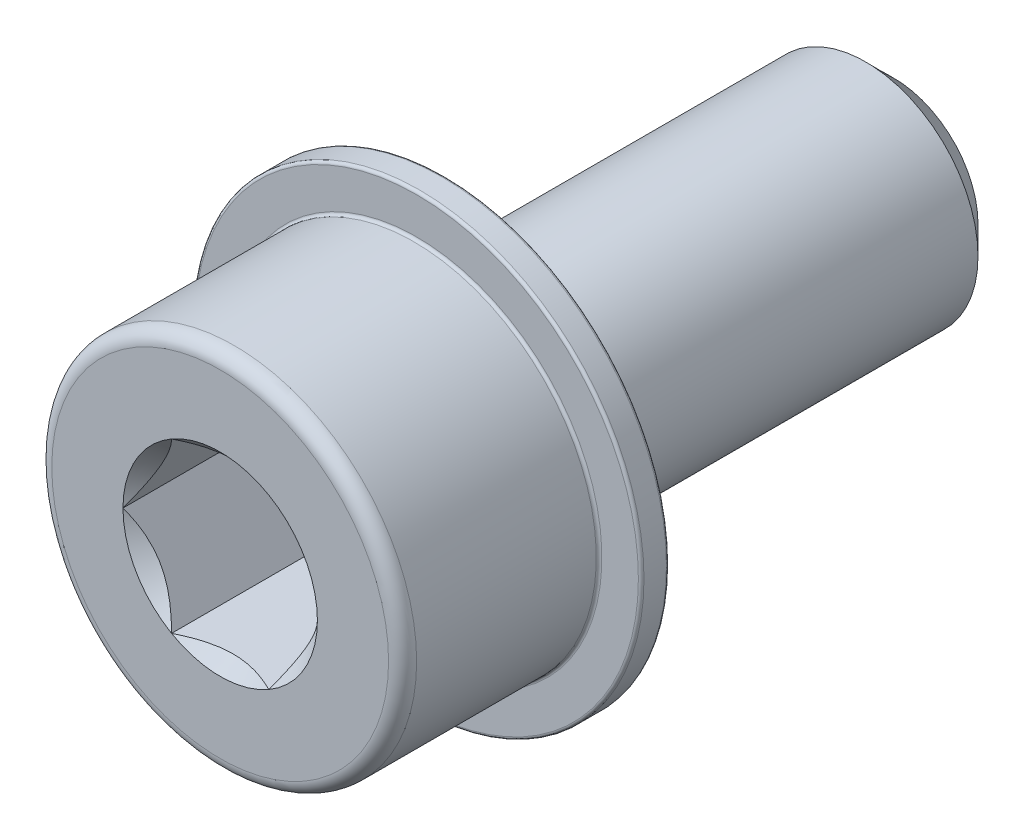
ISO-10303-21;
HEADER;
FILE_DESCRIPTION(('STEP AP214'),'2;1');
FILE_NAME('part.step','',(''),(''),'','','');
FILE_SCHEMA(('AUTOMOTIVE_DESIGN { 1 0 10303 214 1 1 1 1 }'));
ENDSEC;
DATA;
#1=APPLICATION_CONTEXT('core data for automotive mechanical design processes');
#2=APPLICATION_PROTOCOL_DEFINITION('international standard','automotive_design',2000,#1);
#3=PRODUCT_CONTEXT('',#1,'mechanical');
#4=PRODUCT('Part','Part','',(#3));
#5=PRODUCT_RELATED_PRODUCT_CATEGORY('part','',(#4));
#6=PRODUCT_DEFINITION_FORMATION('','',#4);
#7=PRODUCT_DEFINITION_CONTEXT('part definition',#1,'design');
#8=PRODUCT_DEFINITION('design','',#6,#7);
#9=PRODUCT_DEFINITION_SHAPE('','',#8);
#10=(LENGTH_UNIT() NAMED_UNIT(*) SI_UNIT(.MILLI.,.METRE.));
#11=(NAMED_UNIT(*) PLANE_ANGLE_UNIT() SI_UNIT($,.RADIAN.));
#12=(NAMED_UNIT(*) SI_UNIT($,.STERADIAN.) SOLID_ANGLE_UNIT());
#13=UNCERTAINTY_MEASURE_WITH_UNIT(LENGTH_MEASURE(1.E-05),#10,'distance_accuracy_value','');
#14=(GEOMETRIC_REPRESENTATION_CONTEXT(3) GLOBAL_UNCERTAINTY_ASSIGNED_CONTEXT((#13)) GLOBAL_UNIT_ASSIGNED_CONTEXT((#10,
#11,#12)) REPRESENTATION_CONTEXT('',''));
#15=CARTESIAN_POINT('',(0.,0.,0.));
#16=DIRECTION('',(0.,0.,1.));
#17=DIRECTION('',(1.,0.,0.));
#18=AXIS2_PLACEMENT_3D('',#15,#16,#17);
#19=CARTESIAN_POINT('',(0.,0.,24.));
#20=DIRECTION('',(0.,0.,-1.));
#21=DIRECTION('',(-1.,0.,0.));
#22=AXIS2_PLACEMENT_3D('',#19,#20,#21);
#23=CYLINDRICAL_SURFACE('',#22,6.5);
#24=CARTESIAN_POINT('',(0.,0.,17.1));
#25=DIRECTION('',(0.,0.,-1.));
#26=DIRECTION('',(-1.,0.,0.));
#27=AXIS2_PLACEMENT_3D('',#24,#25,#26);
#28=CIRCLE('',#27,6.5);
#29=CARTESIAN_POINT('',(-6.5,0.,17.1));
#30=VERTEX_POINT('',#29);
#31=EDGE_CURVE('E11',#30,#30,#28,.F.);
#32=ORIENTED_EDGE('',*,*,#31,.T.);
#33=EDGE_LOOP('',(#32));
#34=FACE_BOUND('',#33,.T.);
#35=CARTESIAN_POINT('',(0.,0.,23.5));
#36=DIRECTION('',(0.,0.,1.));
#37=DIRECTION('',(1.,0.,0.));
#38=AXIS2_PLACEMENT_3D('',#35,#36,#37);
#39=CIRCLE('',#38,6.5);
#40=CARTESIAN_POINT('',(6.5,0.,23.5));
#41=VERTEX_POINT('',#40);
#42=EDGE_CURVE('E256',#41,#41,#39,.F.);
#43=ORIENTED_EDGE('',*,*,#42,.T.);
#44=EDGE_LOOP('',(#43));
#45=FACE_BOUND('',#44,.T.);
#46=ADVANCED_FACE('F34',(#34,#45),#23,.T.);
#47=CARTESIAN_POINT('',(0.,0.,24.));
#48=DIRECTION('',(0.,0.,1.));
#49=DIRECTION('',(1.,0.,0.));
#50=AXIS2_PLACEMENT_3D('',#47,#48,#49);
#51=PLANE('',#50);
#52=CARTESIAN_POINT('',(0.,0.,24.));
#53=DIRECTION('',(0.,0.,1.));
#54=DIRECTION('',(1.,0.,0.));
#55=AXIS2_PLACEMENT_3D('',#52,#53,#54);
#56=CIRCLE('',#55,6.);
#57=CARTESIAN_POINT('',(6.,0.,24.));
#58=VERTEX_POINT('',#57);
#59=EDGE_CURVE('E107',#58,#58,#56,.T.);
#60=ORIENTED_EDGE('',*,*,#59,.T.);
#61=EDGE_LOOP('',(#60));
#62=FACE_BOUND('',#61,.T.);
#63=CARTESIAN_POINT('',(0.,0.,24.));
#64=DIRECTION('',(0.,0.,1.));
#65=DIRECTION('',(1.,0.,0.));
#66=AXIS2_PLACEMENT_3D('',#63,#64,#65);
#67=CIRCLE('',#66,3.46410161513776);
#68=CARTESIAN_POINT('',(3.46410161513776,0.,24.));
#69=VERTEX_POINT('',#68);
#70=CARTESIAN_POINT('',(1.73205080756888,3.,24.));
#71=VERTEX_POINT('',#70);
#72=EDGE_CURVE('E88',#69,#71,#67,.T.);
#73=ORIENTED_EDGE('',*,*,#72,.F.);
#74=CARTESIAN_POINT('',(1.73205080756888,-3.,24.));
#75=VERTEX_POINT('',#74);
#76=EDGE_CURVE('E48',#75,#69,#67,.T.);
#77=ORIENTED_EDGE('',*,*,#76,.F.);
#78=CARTESIAN_POINT('',(-1.73205080756888,-3.,24.));
#79=VERTEX_POINT('',#78);
#80=EDGE_CURVE('E318',#79,#75,#67,.T.);
#81=ORIENTED_EDGE('',*,*,#80,.F.);
#82=CARTESIAN_POINT('',(-3.46410161513776,0.,24.));
#83=VERTEX_POINT('',#82);
#84=EDGE_CURVE('E55',#83,#79,#67,.T.);
#85=ORIENTED_EDGE('',*,*,#84,.F.);
#86=CARTESIAN_POINT('',(-1.73205080756888,3.,24.));
#87=VERTEX_POINT('',#86);
#88=EDGE_CURVE('E129',#87,#83,#67,.T.);
#89=ORIENTED_EDGE('',*,*,#88,.F.);
#90=EDGE_CURVE('E97',#71,#87,#67,.T.);
#91=ORIENTED_EDGE('',*,*,#90,.F.);
#92=EDGE_LOOP('',(#73,#77,#81,#85,#89,#91));
#93=FACE_BOUND('',#92,.T.);
#94=ADVANCED_FACE('F128',(#62,#93),#51,.T.);
#95=CARTESIAN_POINT('',(0.,0.,24.));
#96=DIRECTION('',(0.,0.,1.));
#97=DIRECTION('',(1.,0.,0.));
#98=AXIS2_PLACEMENT_3D('',#95,#96,#97);
#99=CONICAL_SURFACE('',#98,3.46410161513776,0.785398163397449);
#100=ORIENTED_EDGE('',*,*,#90,.T.);
#101=CARTESIAN_POINT('',(-3.40188153141397,3.,25.071623018675));
#102=CARTESIAN_POINT('',(-3.31880839496225,3.,25.0093307707653));
#103=CARTESIAN_POINT('',(-3.23526432463499,3.,24.9476562262713));
#104=CARTESIAN_POINT('',(-3.06705083944725,3.,24.825817186681));
#105=CARTESIAN_POINT('',(-2.98238114192822,3.,24.7656530822642));
#106=CARTESIAN_POINT('',(-2.81111390830011,3.,24.6466823260063));
#107=CARTESIAN_POINT('',(-2.72450651479474,3.,24.5878898159252));
#108=CARTESIAN_POINT('',(-2.5498128465526,3.,24.4725516902232));
#109=CARTESIAN_POINT('',(-2.46172667795769,3.,24.4160059143113));
#110=CARTESIAN_POINT('',(-2.27892768432208,3.,24.3026064434241));
#111=CARTESIAN_POINT('',(-2.18411772294209,3.,24.2459085325007));
#112=CARTESIAN_POINT('',(-1.99231796342786,3.,24.1363338489189));
#113=CARTESIAN_POINT('',(-1.89532845598629,3.,24.0834565706102));
#114=CARTESIAN_POINT('',(-1.6991502417869,3.,23.9826433846406));
#115=CARTESIAN_POINT('',(-1.59996871640864,3.,23.9346936118117));
#116=CARTESIAN_POINT('',(-1.39893527870468,3.,23.8448170133997));
#117=CARTESIAN_POINT('',(-1.29708458210817,3.,23.8028875002659));
#118=CARTESIAN_POINT('',(-1.0982186531427,3.,23.7293601977538));
#119=CARTESIAN_POINT('',(-1.00140329048655,3.,23.6972274830937));
#120=CARTESIAN_POINT('',(-0.805487586800686,3.,23.6407367466802));
#121=CARTESIAN_POINT('',(-0.706387084473375,3.,23.6163792755582));
#122=CARTESIAN_POINT('',(-0.508116211624926,3.,23.5771014895869));
#123=CARTESIAN_POINT('',(-0.408977763183684,3.,23.5620226377466));
#124=CARTESIAN_POINT('',(-0.209698791301063,3.,23.5415865192691));
#125=CARTESIAN_POINT('',(-0.109558431989066,3.,23.5362276857281));
#126=CARTESIAN_POINT('',(0.0873520516843387,3.,23.535609235846));
#127=CARTESIAN_POINT('',(0.184121252918254,3.,23.5400131533177));
#128=CARTESIAN_POINT('',(0.376804854524576,3.,23.557946416793));
#129=CARTESIAN_POINT('',(0.472719169351943,3.,23.5714766658715));
#130=CARTESIAN_POINT('',(0.66461966332242,3.,23.6071635369876));
#131=CARTESIAN_POINT('',(0.760578448954833,3.,23.6294651712297));
#132=CARTESIAN_POINT('',(0.950411386335508,3.,23.6815211461887));
#133=CARTESIAN_POINT('',(1.04428572934496,3.,23.7112748000321));
#134=CARTESIAN_POINT('',(1.23968230612517,3.,23.7805237867733));
#135=CARTESIAN_POINT('',(1.34095401081408,3.,23.8207192131534));
#136=CARTESIAN_POINT('',(1.54084264319093,3.,23.9072590407946));
#137=CARTESIAN_POINT('',(1.63945865301323,3.,23.9536055360041));
#138=CARTESIAN_POINT('',(1.8345457021536,3.,24.0513511324151));
#139=CARTESIAN_POINT('',(1.93100848905254,3.,24.1027665721575));
#140=CARTESIAN_POINT('',(2.12170828880386,3.,24.2095076183011));
#141=CARTESIAN_POINT('',(2.21594570238894,3.,24.2648325134343));
#142=CARTESIAN_POINT('',(2.39783630702513,3.,24.3757799204079));
#143=CARTESIAN_POINT('',(2.48558325753569,3.,24.4312495308021));
#144=CARTESIAN_POINT('',(2.65957133871347,3.,24.5445092718899));
#145=CARTESIAN_POINT('',(2.74581235420106,3.,24.6022995789736));
#146=CARTESIAN_POINT('',(2.91628413803161,3.,24.7193054641893));
#147=CARTESIAN_POINT('',(3.00052556721126,3.,24.7785055655618));
#148=CARTESIAN_POINT('',(3.16785911169907,3.,24.8984622960702));
#149=CARTESIAN_POINT('',(3.25095153629611,3.,24.9592184932626));
#150=CARTESIAN_POINT('',(3.33356317170769,3.,25.0206105740407));
#151=B_SPLINE_CURVE_WITH_KNOTS('',3,(#101,#102,#103,#104,#105,#106,#107,#108,#109,#110,#111,
#112,#113,#114,#115,#116,#117,#118,#119,#120,#121,#122,#123,#124,#125,#126,#127,#128,#129,#130,
#131,#132,#133,#134,#135,#136,#137,#138,#139,#140,#141,#142,#143,#144,#145,#146,#147,#148,#149,
#150),.UNSPECIFIED.,.F.,.F.,(4,2,2,2,2,2,2,2,2,2,2,2,2,2,2,2,2,2,2,2,2,2,2,2,4),(0.,
0.31150788964413,0.623095538398644,0.937099065704867,1.25108015037407,1.58241857439006,
1.91371306604159,2.24404824101607,2.57423548692227,2.87999017792551,3.18576651722764,
3.486161620239,3.78650829411698,4.07666515932723,4.36685074054528,4.6620503227987,
4.95722270569223,5.28383771583299,5.61056419890145,5.93838056110907,6.26613743475899,
6.57752286720456,6.88893201218749,7.19780024979462,7.50658366111556),.UNSPECIFIED.);
#152=EDGE_CURVE('E102',#71,#87,#151,.F.);
#153=ORIENTED_EDGE('',*,*,#152,.F.);
#154=EDGE_LOOP('',(#100,#153));
#155=FACE_BOUND('',#154,.T.);
#156=ADVANCED_FACE('F103',(#155),#99,.F.);
#157=ORIENTED_EDGE('',*,*,#88,.T.);
#158=CARTESIAN_POINT('',(-1.73193533751504,3.0002,24.0001154758271));
#159=CARTESIAN_POINT('',(-1.79147372663452,2.89707648504425,23.9406283183218));
#160=CARTESIAN_POINT('',(-1.85200767512883,2.79222861066935,23.8846349794655));
#161=CARTESIAN_POINT('',(-1.97544301635334,2.5784323282189,23.7821125963789));
#162=CARTESIAN_POINT('',(-2.03835614749388,2.46946358862024,23.7356405937413));
#163=CARTESIAN_POINT('',(-2.16521745390422,2.24973336040297,23.6560331885163));
#164=CARTESIAN_POINT('',(-2.22913332270057,2.13902782823779,23.6226977006427));
#165=CARTESIAN_POINT('',(-2.35837216363117,1.91517958943467,23.5713375439793));
#166=CARTESIAN_POINT('',(-2.42369118784644,1.802043720793,23.5532745375356));
#167=CARTESIAN_POINT('',(-2.53626564359199,1.60705904380729,23.5369769084505));
#168=CARTESIAN_POINT('',(-2.58337569224233,1.52546204599786,23.5345643671738));
#169=CARTESIAN_POINT('',(-2.67751916315865,1.36240077116991,23.5386294346571));
#170=CARTESIAN_POINT('',(-2.7245525527757,1.28093655070101,23.5451101600283));
#171=CARTESIAN_POINT('',(-2.81817374583237,1.11877988766163,23.5665917225152));
#172=CARTESIAN_POINT('',(-2.86476099147974,1.03808841121569,23.5816020899673));
#173=CARTESIAN_POINT('',(-2.95713536549225,0.878091302108662,23.619323646066));
#174=CARTESIAN_POINT('',(-3.00292255491614,0.798785563690701,23.6420342443228));
#175=CARTESIAN_POINT('',(-3.0842086834051,0.657993859197245,23.6887606848539));
#176=CARTESIAN_POINT('',(-3.11988753362891,0.596196277853973,23.7115483276808));
#177=CARTESIAN_POINT('',(-3.19060468282508,0.473710582479779,23.7607962860574));
#178=CARTESIAN_POINT('',(-3.2256429622163,0.413022502364395,23.7872567136662));
#179=CARTESIAN_POINT('',(-3.29496858432308,0.292947002609136,23.8432569943914));
#180=CARTESIAN_POINT('',(-3.32925789884291,0.233556167704082,23.8727871644784));
#181=CARTESIAN_POINT('',(-3.39720147685868,0.115874438532731,23.9345390915755));
#182=CARTESIAN_POINT('',(-3.43085611477446,0.0575828957522661,23.9667591966594));
#183=CARTESIAN_POINT('',(-3.46421708519159,-0.000200000000000237,24.0001154758271));
#184=B_SPLINE_CURVE_WITH_KNOTS('',3,(#158,#159,#160,#161,#162,#163,#164,#165,#166,#167,#168,
#169,#170,#171,#172,#173,#174,#175,#176,#177,#178,#179,#180,#181,#182,#183),.UNSPECIFIED.,.F.,
.F.,(4,2,2,2,2,2,2,2,2,2,2,2,4),(0.,0.399603557139308,0.801535286397847,1.19708369162343,
1.59163620080173,1.87398941755845,2.15644160919093,2.43921001247426,2.72195674032138,
2.94657516661927,3.17120044767274,3.3951375283781,3.61893808380739),.UNSPECIFIED.);
#185=EDGE_CURVE('E96',#87,#83,#184,.T.);
#186=ORIENTED_EDGE('',*,*,#185,.F.);
#187=EDGE_LOOP('',(#157,#186));
#188=FACE_BOUND('',#187,.T.);
#189=ADVANCED_FACE('F324',(#188),#99,.F.);
#190=ORIENTED_EDGE('',*,*,#84,.T.);
#191=CARTESIAN_POINT('',(-3.46421708519159,0.000199999999999766,24.0001154758271));
#192=CARTESIAN_POINT('',(-3.40467869607211,-0.102923514955749,23.9406283183218));
#193=CARTESIAN_POINT('',(-3.3441447475778,-0.207771389330651,23.8846349794655));
#194=CARTESIAN_POINT('',(-3.22070940635329,-0.421567671781097,23.7821125963789));
#195=CARTESIAN_POINT('',(-3.15779627521275,-0.53053641137976,23.7356405937413));
#196=CARTESIAN_POINT('',(-3.03093496880241,-0.750266639597028,23.6560331885163));
#197=CARTESIAN_POINT('',(-2.96701910000606,-0.860972171762211,23.6226977006427));
#198=CARTESIAN_POINT('',(-2.83778025907546,-1.08482041056532,23.5713375439793));
#199=CARTESIAN_POINT('',(-2.77246123486019,-1.19795627920699,23.5532745375356));
#200=CARTESIAN_POINT('',(-2.65988677911464,-1.3929409561927,23.5369769084505));
#201=CARTESIAN_POINT('',(-2.6127767304643,-1.47453795400213,23.5345643671738));
#202=CARTESIAN_POINT('',(-2.51863325954798,-1.63759922883009,23.5386294346571));
#203=CARTESIAN_POINT('',(-2.47159986993094,-1.71906344929899,23.5451101600283));
#204=CARTESIAN_POINT('',(-2.37797867687426,-1.88122011233837,23.5665917225152));
#205=CARTESIAN_POINT('',(-2.33139143122689,-1.9619115887843,23.5816020899673));
#206=CARTESIAN_POINT('',(-2.23901705721438,-2.12190869789133,23.619323646066));
#207=CARTESIAN_POINT('',(-2.19322986779049,-2.20121443630929,23.6420342443228));
#208=CARTESIAN_POINT('',(-2.11194373930153,-2.34200614080275,23.6887606848539));
#209=CARTESIAN_POINT('',(-2.07626488907772,-2.40380372214602,23.7115483276808));
#210=CARTESIAN_POINT('',(-2.00554773988155,-2.52628941752022,23.7607962860574));
#211=CARTESIAN_POINT('',(-1.97050946049033,-2.5869774976356,23.7872567136662));
#212=CARTESIAN_POINT('',(-1.90118383838356,-2.70705299739086,23.8432569943914));
#213=CARTESIAN_POINT('',(-1.86689452386373,-2.76644383229592,23.8727871644784));
#214=CARTESIAN_POINT('',(-1.79895094584795,-2.88412556146727,23.9345390915755));
#215=CARTESIAN_POINT('',(-1.76529630793216,-2.94241710424773,23.9667591966594));
#216=CARTESIAN_POINT('',(-1.73193533751504,-3.0002,24.0001154758271));
#217=B_SPLINE_CURVE_WITH_KNOTS('',3,(#191,#192,#193,#194,#195,#196,#197,#198,#199,#200,#201,
#202,#203,#204,#205,#206,#207,#208,#209,#210,#211,#212,#213,#214,#215,#216),.UNSPECIFIED.,.F.,
.F.,(4,2,2,2,2,2,2,2,2,2,2,2,4),(0.,0.399603557139307,0.801535286397845,1.19708369162343,
1.59163620080173,1.87398941755844,2.15644160919092,2.43921001247425,2.72195674032138,
2.94657516661926,3.17120044767274,3.3951375283781,3.61893808380739),.UNSPECIFIED.);
#218=EDGE_CURVE('E139',#83,#79,#217,.T.);
#219=ORIENTED_EDGE('',*,*,#218,.F.);
#220=EDGE_LOOP('',(#190,#219));
#221=FACE_BOUND('',#220,.T.);
#222=ADVANCED_FACE('F326',(#221),#99,.F.);
#223=ORIENTED_EDGE('',*,*,#80,.T.);
#224=CARTESIAN_POINT('',(-3.40188153141397,-3.,25.071623018675));
#225=CARTESIAN_POINT('',(-3.31880839496224,-3.,25.0093307707653));
#226=CARTESIAN_POINT('',(-3.23526432463498,-3.,24.9476562262713));
#227=CARTESIAN_POINT('',(-3.06705083944724,-3.,24.825817186681));
#228=CARTESIAN_POINT('',(-2.98238114192821,-3.,24.7656530822642));
#229=CARTESIAN_POINT('',(-2.81111390830011,-3.,24.6466823260063));
#230=CARTESIAN_POINT('',(-2.72450651479473,-3.,24.5878898159252));
#231=CARTESIAN_POINT('',(-2.54981284655259,-3.,24.4725516902232));
#232=CARTESIAN_POINT('',(-2.46172667795768,-3.,24.4160059143113));
#233=CARTESIAN_POINT('',(-2.27892768432207,-3.,24.3026064434241));
#234=CARTESIAN_POINT('',(-2.18411772294209,-3.,24.2459085325007));
#235=CARTESIAN_POINT('',(-1.99231796342786,-3.,24.1363338489189));
#236=CARTESIAN_POINT('',(-1.89532845598629,-3.,24.0834565706102));
#237=CARTESIAN_POINT('',(-1.69915024178689,-3.,23.9826433846406));
#238=CARTESIAN_POINT('',(-1.59996871640864,-3.,23.9346936118117));
#239=CARTESIAN_POINT('',(-1.39893527870468,-3.,23.8448170133997));
#240=CARTESIAN_POINT('',(-1.29708458210817,-3.,23.8028875002659));
#241=CARTESIAN_POINT('',(-1.0982186531427,-3.,23.7293601977538));
#242=CARTESIAN_POINT('',(-1.00140329048654,-3.,23.6972274830937));
#243=CARTESIAN_POINT('',(-0.805487586800684,-3.,23.6407367466802));
#244=CARTESIAN_POINT('',(-0.706387084473374,-3.,23.6163792755582));
#245=CARTESIAN_POINT('',(-0.508116211624925,-3.,23.5771014895869));
#246=CARTESIAN_POINT('',(-0.408977763183682,-3.,23.5620226377466));
#247=CARTESIAN_POINT('',(-0.20969879130106,-3.,23.5415865192691));
#248=CARTESIAN_POINT('',(-0.109558431989063,-3.,23.5362276857281));
#249=CARTESIAN_POINT('',(0.0873520516843421,-3.,23.535609235846));
#250=CARTESIAN_POINT('',(0.184121252918257,-3.,23.5400131533177));
#251=CARTESIAN_POINT('',(0.376804854524579,-3.,23.557946416793));
#252=CARTESIAN_POINT('',(0.472719169351945,-3.,23.5714766658715));
#253=CARTESIAN_POINT('',(0.664619663322421,-3.,23.6071635369876));
#254=CARTESIAN_POINT('',(0.760578448954833,-3.,23.6294651712297));
#255=CARTESIAN_POINT('',(0.950411386335509,-3.,23.6815211461887));
#256=CARTESIAN_POINT('',(1.04428572934496,-3.,23.7112748000321));
#257=CARTESIAN_POINT('',(1.23968230612517,-3.,23.7805237867733));
#258=CARTESIAN_POINT('',(1.34095401081408,-3.,23.8207192131534));
#259=CARTESIAN_POINT('',(1.54084264319093,-3.,23.9072590407946));
#260=CARTESIAN_POINT('',(1.63945865301323,-3.,23.9536055360041));
#261=CARTESIAN_POINT('',(1.8345457021536,-3.,24.0513511324151));
#262=CARTESIAN_POINT('',(1.93100848905254,-3.,24.1027665721575));
#263=CARTESIAN_POINT('',(2.12170828880386,-3.,24.2095076183011));
#264=CARTESIAN_POINT('',(2.21594570238895,-3.,24.2648325134343));
#265=CARTESIAN_POINT('',(2.39783630702514,-3.,24.3757799204079));
#266=CARTESIAN_POINT('',(2.48558325753569,-3.,24.4312495308021));
#267=CARTESIAN_POINT('',(2.65957133871347,-3.,24.5445092718899));
#268=CARTESIAN_POINT('',(2.74581235420107,-3.,24.6022995789736));
#269=CARTESIAN_POINT('',(2.91628413803161,-3.,24.7193054641893));
#270=CARTESIAN_POINT('',(3.00052556721127,-3.,24.7785055655618));
#271=CARTESIAN_POINT('',(3.16785911169908,-3.,24.8984622960703));
#272=CARTESIAN_POINT('',(3.25095153629611,-3.,24.9592184932626));
#273=CARTESIAN_POINT('',(3.3335631717077,-3.,25.0206105740407));
#274=B_SPLINE_CURVE_WITH_KNOTS('',3,(#224,#225,#226,#227,#228,#229,#230,#231,#232,#233,#234,
#235,#236,#237,#238,#239,#240,#241,#242,#243,#244,#245,#246,#247,#248,#249,#250,#251,#252,#253,
#254,#255,#256,#257,#258,#259,#260,#261,#262,#263,#264,#265,#266,#267,#268,#269,#270,#271,#272,
#273),.UNSPECIFIED.,.F.,.F.,(4,2,2,2,2,2,2,2,2,2,2,2,2,2,2,2,2,2,2,2,2,2,2,2,4),(0.,
0.311507889644128,0.623095538398643,0.937099065704863,1.25108015037407,1.58241857439006,
1.91371306604158,2.24404824101606,2.57423548692226,2.8799901779255,3.18576651722763,
3.486161620239,3.78650829411697,4.07666515932722,4.36685074054527,4.66205032279869,
4.95722270569223,5.28383771583299,5.61056419890145,5.93838056110906,6.26613743475899,
6.57752286720455,6.88893201218749,7.19780024979462,7.50658366111556),.UNSPECIFIED.);
#275=EDGE_CURVE('E169',#79,#75,#274,.T.);
#276=ORIENTED_EDGE('',*,*,#275,.F.);
#277=EDGE_LOOP('',(#223,#276));
#278=FACE_BOUND('',#277,.T.);
#279=ADVANCED_FACE('F319',(#278),#99,.F.);
#280=ORIENTED_EDGE('',*,*,#76,.T.);
#281=CARTESIAN_POINT('',(1.73193533751504,-3.0002,24.0001154758272));
#282=CARTESIAN_POINT('',(1.79147372663452,-2.89707648504425,23.9406283183218));
#283=CARTESIAN_POINT('',(1.85200767512883,-2.79222861066935,23.8846349794655));
#284=CARTESIAN_POINT('',(1.97544301635334,-2.57843232821891,23.7821125963789));
#285=CARTESIAN_POINT('',(2.03835614749388,-2.46946358862024,23.7356405937413));
#286=CARTESIAN_POINT('',(2.16521745390422,-2.24973336040297,23.6560331885163));
#287=CARTESIAN_POINT('',(2.22913332270057,-2.13902782823779,23.6226977006427));
#288=CARTESIAN_POINT('',(2.35837216363117,-1.91517958943468,23.5713375439793));
#289=CARTESIAN_POINT('',(2.42369118784644,-1.80204372079301,23.5532745375356));
#290=CARTESIAN_POINT('',(2.53626564359199,-1.6070590438073,23.5369769084505));
#291=CARTESIAN_POINT('',(2.58337569224233,-1.52546204599787,23.5345643671738));
#292=CARTESIAN_POINT('',(2.67751916315865,-1.36240077116991,23.5386294346571));
#293=CARTESIAN_POINT('',(2.7245525527757,-1.28093655070101,23.5451101600283));
#294=CARTESIAN_POINT('',(2.81817374583237,-1.11877988766163,23.5665917225152));
#295=CARTESIAN_POINT('',(2.86476099147974,-1.0380884112157,23.5816020899673));
#296=CARTESIAN_POINT('',(2.95713536549225,-0.878091302108666,23.619323646066));
#297=CARTESIAN_POINT('',(3.00292255491614,-0.798785563690705,23.6420342443228));
#298=CARTESIAN_POINT('',(3.0842086834051,-0.657993859197248,23.6887606848539));
#299=CARTESIAN_POINT('',(3.11988753362891,-0.596196277853976,23.7115483276808));
#300=CARTESIAN_POINT('',(3.19060468282508,-0.473710582479783,23.7607962860574));
#301=CARTESIAN_POINT('',(3.2256429622163,-0.413022502364399,23.7872567136662));
#302=CARTESIAN_POINT('',(3.29496858432308,-0.292947002609139,23.8432569943914));
#303=CARTESIAN_POINT('',(3.32925789884291,-0.233556167704083,23.8727871644784));
#304=CARTESIAN_POINT('',(3.39720147685869,-0.115874438532732,23.9345390915755));
#305=CARTESIAN_POINT('',(3.43085611477447,-0.0575828957522665,23.9667591966594));
#306=CARTESIAN_POINT('',(3.46421708519159,0.000199999999999132,24.0001154758271));
#307=B_SPLINE_CURVE_WITH_KNOTS('',3,(#281,#282,#283,#284,#285,#286,#287,#288,#289,#290,#291,
#292,#293,#294,#295,#296,#297,#298,#299,#300,#301,#302,#303,#304,#305,#306),.UNSPECIFIED.,.F.,
.F.,(4,2,2,2,2,2,2,2,2,2,2,2,4),(0.,0.399603557139308,0.801535286397848,1.19708369162343,
1.59163620080173,1.87398941755845,2.15644160919093,2.43921001247425,2.72195674032138,
2.94657516661927,3.17120044767274,3.3951375283781,3.61893808380739),.UNSPECIFIED.);
#308=EDGE_CURVE('E118',#75,#69,#307,.T.);
#309=ORIENTED_EDGE('',*,*,#308,.F.);
#310=EDGE_LOOP('',(#280,#309));
#311=FACE_BOUND('',#310,.T.);
#312=ADVANCED_FACE('F154',(#311),#99,.F.);
#313=ORIENTED_EDGE('',*,*,#72,.T.);
#314=CARTESIAN_POINT('',(3.46421708519159,-0.000199999999999999,24.0001154758272));
#315=CARTESIAN_POINT('',(3.40467869607211,0.102923514955748,23.9406283183218));
#316=CARTESIAN_POINT('',(3.3441447475778,0.20777138933065,23.8846349794655));
#317=CARTESIAN_POINT('',(3.2207094063533,0.421567671781096,23.7821125963789));
#318=CARTESIAN_POINT('',(3.15779627521275,0.530536411379761,23.7356405937413));
#319=CARTESIAN_POINT('',(3.03093496880241,0.75026663959703,23.6560331885163));
#320=CARTESIAN_POINT('',(2.96701910000607,0.860972171762214,23.6226977006427));
#321=CARTESIAN_POINT('',(2.83778025907546,1.08482041056533,23.5713375439793));
#322=CARTESIAN_POINT('',(2.77246123486019,1.197956279207,23.5532745375356));
#323=CARTESIAN_POINT('',(2.65988677911464,1.3929409561927,23.5369769084505));
#324=CARTESIAN_POINT('',(2.6127767304643,1.47453795400214,23.5345643671738));
#325=CARTESIAN_POINT('',(2.51863325954798,1.63759922883009,23.5386294346571));
#326=CARTESIAN_POINT('',(2.47159986993094,1.71906344929899,23.5451101600283));
#327=CARTESIAN_POINT('',(2.37797867687426,1.88122011233837,23.5665917225152));
#328=CARTESIAN_POINT('',(2.33139143122689,1.9619115887843,23.5816020899673));
#329=CARTESIAN_POINT('',(2.23901705721438,2.12190869789134,23.619323646066));
#330=CARTESIAN_POINT('',(2.19322986779049,2.2012144363093,23.6420342443228));
#331=CARTESIAN_POINT('',(2.11194373930153,2.34200614080275,23.6887606848539));
#332=CARTESIAN_POINT('',(2.07626488907772,2.40380372214603,23.7115483276808));
#333=CARTESIAN_POINT('',(2.00554773988155,2.52628941752022,23.7607962860574));
#334=CARTESIAN_POINT('',(1.97050946049034,2.5869774976356,23.7872567136662));
#335=CARTESIAN_POINT('',(1.90118383838356,2.70705299739086,23.8432569943914));
#336=CARTESIAN_POINT('',(1.86689452386373,2.76644383229592,23.8727871644784));
#337=CARTESIAN_POINT('',(1.79895094584795,2.88412556146727,23.9345390915755));
#338=CARTESIAN_POINT('',(1.76529630793217,2.94241710424774,23.9667591966594));
#339=CARTESIAN_POINT('',(1.73193533751504,3.0002,24.0001154758271));
#340=B_SPLINE_CURVE_WITH_KNOTS('',3,(#314,#315,#316,#317,#318,#319,#320,#321,#322,#323,#324,
#325,#326,#327,#328,#329,#330,#331,#332,#333,#334,#335,#336,#337,#338,#339),.UNSPECIFIED.,.F.,
.F.,(4,2,2,2,2,2,2,2,2,2,2,2,4),(0.,0.399603557139308,0.801535286397848,1.19708369162343,
1.59163620080173,1.87398941755845,2.15644160919093,2.43921001247425,2.72195674032138,
2.94657516661927,3.17120044767274,3.3951375283781,3.61893808380739),.UNSPECIFIED.);
#341=EDGE_CURVE('E92',#69,#71,#340,.T.);
#342=ORIENTED_EDGE('',*,*,#341,.F.);
#343=EDGE_LOOP('',(#313,#342));
#344=FACE_BOUND('',#343,.T.);
#345=ADVANCED_FACE('F90',(#344),#99,.F.);
#346=CARTESIAN_POINT('',(0.,0.,18.));
#347=DIRECTION('',(0.,0.,1.));
#348=DIRECTION('',(1.,0.,0.));
#349=AXIS2_PLACEMENT_3D('',#346,#347,#348);
#350=PLANE('',#349);
#351=DIRECTION('',(-0.5,0.866025403784439,0.));
#352=VECTOR('',#351,1.);
#353=CARTESIAN_POINT('',(3.46410161513776,0.,18.));
#354=LINE('',#353,#352);
#355=CARTESIAN_POINT('',(3.46410161513776,0.,18.));
#356=VERTEX_POINT('',#355);
#357=CARTESIAN_POINT('',(1.73205080756888,3.,18.));
#358=VERTEX_POINT('',#357);
#359=EDGE_CURVE('E117',#356,#358,#354,.T.);
#360=ORIENTED_EDGE('',*,*,#359,.T.);
#361=DIRECTION('',(-1.,0.,0.));
#362=VECTOR('',#361,1.);
#363=CARTESIAN_POINT('',(1.73205080756888,3.,18.));
#364=LINE('',#363,#362);
#365=CARTESIAN_POINT('',(-1.73205080756888,3.,18.));
#366=VERTEX_POINT('',#365);
#367=EDGE_CURVE('E122',#358,#366,#364,.T.);
#368=ORIENTED_EDGE('',*,*,#367,.T.);
#369=DIRECTION('',(-0.5,-0.866025403784439,0.));
#370=VECTOR('',#369,1.);
#371=CARTESIAN_POINT('',(-1.73205080756888,3.,18.));
#372=LINE('',#371,#370);
#373=CARTESIAN_POINT('',(-3.46410161513775,0.,18.));
#374=VERTEX_POINT('',#373);
#375=EDGE_CURVE('E308',#366,#374,#372,.T.);
#376=ORIENTED_EDGE('',*,*,#375,.T.);
#377=DIRECTION('',(0.5,-0.866025403784439,0.));
#378=VECTOR('',#377,1.);
#379=CARTESIAN_POINT('',(-3.46410161513775,0.,18.));
#380=LINE('',#379,#378);
#381=CARTESIAN_POINT('',(-1.73205080756887,-3.,18.));
#382=VERTEX_POINT('',#381);
#383=EDGE_CURVE('E305',#374,#382,#380,.T.);
#384=ORIENTED_EDGE('',*,*,#383,.T.);
#385=DIRECTION('',(1.,0.,0.));
#386=VECTOR('',#385,1.);
#387=CARTESIAN_POINT('',(-1.73205080756887,-3.,18.));
#388=LINE('',#387,#386);
#389=CARTESIAN_POINT('',(1.73205080756888,-3.,18.));
#390=VERTEX_POINT('',#389);
#391=EDGE_CURVE('E302',#382,#390,#388,.T.);
#392=ORIENTED_EDGE('',*,*,#391,.T.);
#393=DIRECTION('',(0.5,0.866025403784439,0.));
#394=VECTOR('',#393,1.);
#395=CARTESIAN_POINT('',(1.73205080756888,-3.,18.));
#396=LINE('',#395,#394);
#397=EDGE_CURVE('E125',#390,#356,#396,.T.);
#398=ORIENTED_EDGE('',*,*,#397,.T.);
#399=EDGE_LOOP('',(#360,#368,#376,#384,#392,#398));
#400=FACE_BOUND('',#399,.T.);
#401=ADVANCED_FACE('F153',(#400),#350,.T.);
#402=CARTESIAN_POINT('',(1.73205080756888,3.,18.));
#403=DIRECTION('',(0.,1.,0.));
#404=DIRECTION('',(-1.,0.,0.));
#405=AXIS2_PLACEMENT_3D('',#402,#403,#404);
#406=PLANE('',#405);
#407=DIRECTION('',(0.,0.,1.));
#408=VECTOR('',#407,1.);
#409=CARTESIAN_POINT('',(1.73205080756888,3.,18.));
#410=LINE('',#409,#408);
#411=EDGE_CURVE('E114',#358,#71,#410,.T.);
#412=ORIENTED_EDGE('',*,*,#411,.T.);
#413=ORIENTED_EDGE('',*,*,#152,.T.);
#414=DIRECTION('',(0.,0.,1.));
#415=VECTOR('',#414,1.);
#416=CARTESIAN_POINT('',(-1.73205080756888,3.,18.));
#417=LINE('',#416,#415);
#418=EDGE_CURVE('E124',#366,#87,#417,.T.);
#419=ORIENTED_EDGE('',*,*,#418,.F.);
#420=ORIENTED_EDGE('',*,*,#367,.F.);
#421=EDGE_LOOP('',(#412,#413,#419,#420));
#422=FACE_BOUND('',#421,.T.);
#423=ADVANCED_FACE('F120',(#422),#406,.F.);
#424=CARTESIAN_POINT('',(-1.73205080756888,3.,18.));
#425=DIRECTION('',(-0.866025403784439,0.5,0.));
#426=DIRECTION('',(-0.5,-0.866025403784439,0.));
#427=AXIS2_PLACEMENT_3D('',#424,#425,#426);
#428=PLANE('',#427);
#429=ORIENTED_EDGE('',*,*,#418,.T.);
#430=ORIENTED_EDGE('',*,*,#185,.T.);
#431=DIRECTION('',(0.,0.,1.));
#432=VECTOR('',#431,1.);
#433=CARTESIAN_POINT('',(-3.46410161513775,0.,18.));
#434=LINE('',#433,#432);
#435=EDGE_CURVE('E294',#374,#83,#434,.T.);
#436=ORIENTED_EDGE('',*,*,#435,.F.);
#437=ORIENTED_EDGE('',*,*,#375,.F.);
#438=EDGE_LOOP('',(#429,#430,#436,#437));
#439=FACE_BOUND('',#438,.T.);
#440=ADVANCED_FACE('F146',(#439),#428,.F.);
#441=CARTESIAN_POINT('',(-3.46410161513775,0.,18.));
#442=DIRECTION('',(-0.866025403784439,-0.5,0.));
#443=DIRECTION('',(0.5,-0.866025403784439,0.));
#444=AXIS2_PLACEMENT_3D('',#441,#442,#443);
#445=PLANE('',#444);
#446=ORIENTED_EDGE('',*,*,#435,.T.);
#447=ORIENTED_EDGE('',*,*,#218,.T.);
#448=DIRECTION('',(0.,0.,1.));
#449=VECTOR('',#448,1.);
#450=CARTESIAN_POINT('',(-1.73205080756887,-3.,18.));
#451=LINE('',#450,#449);
#452=EDGE_CURVE('E296',#382,#79,#451,.T.);
#453=ORIENTED_EDGE('',*,*,#452,.F.);
#454=ORIENTED_EDGE('',*,*,#383,.F.);
#455=EDGE_LOOP('',(#446,#447,#453,#454));
#456=FACE_BOUND('',#455,.T.);
#457=ADVANCED_FACE('F193',(#456),#445,.F.);
#458=CARTESIAN_POINT('',(-1.73205080756887,-3.,18.));
#459=DIRECTION('',(0.,-1.,0.));
#460=DIRECTION('',(1.,0.,0.));
#461=AXIS2_PLACEMENT_3D('',#458,#459,#460);
#462=PLANE('',#461);
#463=ORIENTED_EDGE('',*,*,#452,.T.);
#464=ORIENTED_EDGE('',*,*,#275,.T.);
#465=DIRECTION('',(0.,0.,1.));
#466=VECTOR('',#465,1.);
#467=CARTESIAN_POINT('',(1.73205080756888,-3.,18.));
#468=LINE('',#467,#466);
#469=EDGE_CURVE('E286',#390,#75,#468,.T.);
#470=ORIENTED_EDGE('',*,*,#469,.F.);
#471=ORIENTED_EDGE('',*,*,#391,.F.);
#472=EDGE_LOOP('',(#463,#464,#470,#471));
#473=FACE_BOUND('',#472,.T.);
#474=ADVANCED_FACE('F189',(#473),#462,.F.);
#475=CARTESIAN_POINT('',(1.73205080756888,-3.,18.));
#476=DIRECTION('',(0.866025403784439,-0.5,0.));
#477=DIRECTION('',(0.5,0.866025403784439,0.));
#478=AXIS2_PLACEMENT_3D('',#475,#476,#477);
#479=PLANE('',#478);
#480=ORIENTED_EDGE('',*,*,#469,.T.);
#481=ORIENTED_EDGE('',*,*,#308,.T.);
#482=DIRECTION('',(0.,0.,1.));
#483=VECTOR('',#482,1.);
#484=CARTESIAN_POINT('',(3.46410161513776,0.,18.));
#485=LINE('',#484,#483);
#486=EDGE_CURVE('E116',#356,#69,#485,.T.);
#487=ORIENTED_EDGE('',*,*,#486,.F.);
#488=ORIENTED_EDGE('',*,*,#397,.F.);
#489=EDGE_LOOP('',(#480,#481,#487,#488));
#490=FACE_BOUND('',#489,.T.);
#491=ADVANCED_FACE('F186',(#490),#479,.F.);
#492=CARTESIAN_POINT('',(3.46410161513776,0.,18.));
#493=DIRECTION('',(0.866025403784438,0.5,0.));
#494=DIRECTION('',(-0.5,0.866025403784439,0.));
#495=AXIS2_PLACEMENT_3D('',#492,#493,#494);
#496=PLANE('',#495);
#497=ORIENTED_EDGE('',*,*,#486,.T.);
#498=ORIENTED_EDGE('',*,*,#341,.T.);
#499=ORIENTED_EDGE('',*,*,#411,.F.);
#500=ORIENTED_EDGE('',*,*,#359,.F.);
#501=EDGE_LOOP('',(#497,#498,#499,#500));
#502=FACE_BOUND('',#501,.T.);
#503=ADVANCED_FACE('F112',(#502),#496,.F.);
#504=CARTESIAN_POINT('',(0.,0.,23.5));
#505=DIRECTION('',(0.,0.,1.));
#506=DIRECTION('',(1.,0.,0.));
#507=AXIS2_PLACEMENT_3D('',#504,#505,#506);
#508=TOROIDAL_SURFACE('',#507,6.,0.5);
#509=ORIENTED_EDGE('',*,*,#42,.F.);
#510=EDGE_LOOP('',(#509));
#511=FACE_BOUND('',#510,.T.);
#512=ORIENTED_EDGE('',*,*,#59,.F.);
#513=EDGE_LOOP('',(#512));
#514=FACE_BOUND('',#513,.T.);
#515=ADVANCED_FACE('F228',(#511,#514),#508,.T.);
#516=CARTESIAN_POINT('',(0.,0.,17.));
#517=DIRECTION('',(0.,0.,-1.));
#518=DIRECTION('',(-1.,0.,0.));
#519=AXIS2_PLACEMENT_3D('',#516,#517,#518);
#520=CYLINDRICAL_SURFACE('',#519,8.);
#521=CARTESIAN_POINT('',(0.,0.,16.1));
#522=DIRECTION('',(0.,0.,1.));
#523=DIRECTION('',(1.,0.,0.));
#524=AXIS2_PLACEMENT_3D('',#521,#522,#523);
#525=CIRCLE('',#524,8.);
#526=CARTESIAN_POINT('',(8.,0.,16.1));
#527=VERTEX_POINT('',#526);
#528=EDGE_CURVE('E249',#527,#527,#525,.T.);
#529=ORIENTED_EDGE('',*,*,#528,.T.);
#530=EDGE_LOOP('',(#529));
#531=FACE_BOUND('',#530,.T.);
#532=CARTESIAN_POINT('',(0.,0.,16.9));
#533=DIRECTION('',(0.,0.,-1.));
#534=DIRECTION('',(-1.,0.,0.));
#535=AXIS2_PLACEMENT_3D('',#532,#533,#534);
#536=CIRCLE('',#535,8.);
#537=CARTESIAN_POINT('',(-8.,0.,16.9));
#538=VERTEX_POINT('',#537);
#539=EDGE_CURVE('E247',#538,#538,#536,.T.);
#540=ORIENTED_EDGE('',*,*,#539,.T.);
#541=EDGE_LOOP('',(#540));
#542=FACE_BOUND('',#541,.T.);
#543=ADVANCED_FACE('F155',(#531,#542),#520,.T.);
#544=CARTESIAN_POINT('',(0.,0.,17.));
#545=DIRECTION('',(0.,0.,-1.));
#546=DIRECTION('',(-1.,0.,0.));
#547=AXIS2_PLACEMENT_3D('',#544,#545,#546);
#548=PLANE('',#547);
#549=CARTESIAN_POINT('',(0.,0.,17.));
#550=DIRECTION('',(0.,0.,-1.));
#551=DIRECTION('',(-1.,0.,0.));
#552=AXIS2_PLACEMENT_3D('',#549,#550,#551);
#553=CIRCLE('',#552,7.9);
#554=CARTESIAN_POINT('',(-7.9,0.,17.));
#555=VERTEX_POINT('',#554);
#556=EDGE_CURVE('E42',#555,#555,#553,.F.);
#557=ORIENTED_EDGE('',*,*,#556,.T.);
#558=EDGE_LOOP('',(#557));
#559=FACE_BOUND('',#558,.T.);
#560=CARTESIAN_POINT('',(0.,0.,17.));
#561=DIRECTION('',(0.,0.,-1.));
#562=DIRECTION('',(-1.,0.,0.));
#563=AXIS2_PLACEMENT_3D('',#560,#561,#562);
#564=CIRCLE('',#563,6.6);
#565=CARTESIAN_POINT('',(-6.6,0.,17.));
#566=VERTEX_POINT('',#565);
#567=EDGE_CURVE('E253',#566,#566,#564,.T.);
#568=ORIENTED_EDGE('',*,*,#567,.T.);
#569=EDGE_LOOP('',(#568));
#570=FACE_BOUND('',#569,.T.);
#571=ADVANCED_FACE('F219',(#559,#570),#548,.F.);
#572=CARTESIAN_POINT('',(0.,0.,0.));
#573=DIRECTION('',(0.,0.,1.));
#574=DIRECTION('',(1.,0.,0.));
#575=AXIS2_PLACEMENT_3D('',#572,#573,#574);
#576=PLANE('',#575);
#577=CARTESIAN_POINT('',(0.,0.,0.));
#578=DIRECTION('',(0.,0.,1.));
#579=DIRECTION('',(1.,0.,0.));
#580=AXIS2_PLACEMENT_3D('',#577,#578,#579);
#581=CIRCLE('',#580,3.);
#582=CARTESIAN_POINT('',(3.,0.,0.));
#583=VERTEX_POINT('',#582);
#584=EDGE_CURVE('E108',#583,#583,#581,.F.);
#585=ORIENTED_EDGE('',*,*,#584,.T.);
#586=EDGE_LOOP('',(#585));
#587=FACE_BOUND('',#586,.T.);
#588=ADVANCED_FACE('F215',(#587),#576,.F.);
#589=CARTESIAN_POINT('',(0.,0.,0.999999999999997));
#590=DIRECTION('',(0.,0.,1.));
#591=DIRECTION('',(1.,0.,0.));
#592=AXIS2_PLACEMENT_3D('',#589,#590,#591);
#593=CONICAL_SURFACE('',#592,4.,0.785398163397451);
#594=ORIENTED_EDGE('',*,*,#584,.F.);
#595=EDGE_LOOP('',(#594));
#596=FACE_BOUND('',#595,.T.);
#597=CARTESIAN_POINT('',(0.,0.,0.999999999999997));
#598=DIRECTION('',(0.,0.,1.));
#599=DIRECTION('',(1.,0.,0.));
#600=AXIS2_PLACEMENT_3D('',#597,#598,#599);
#601=CIRCLE('',#600,4.);
#602=CARTESIAN_POINT('',(4.,0.,0.999999999999997));
#603=VERTEX_POINT('',#602);
#604=EDGE_CURVE('E282',#603,#603,#601,.T.);
#605=ORIENTED_EDGE('',*,*,#604,.F.);
#606=EDGE_LOOP('',(#605));
#607=FACE_BOUND('',#606,.T.);
#608=ADVANCED_FACE('F218',(#596,#607),#593,.T.);
#609=CARTESIAN_POINT('',(0.,0.,16.));
#610=DIRECTION('',(0.,0.,-1.));
#611=DIRECTION('',(-1.,0.,0.));
#612=AXIS2_PLACEMENT_3D('',#609,#610,#611);
#613=CYLINDRICAL_SURFACE('',#612,4.);
#614=ORIENTED_EDGE('',*,*,#604,.T.);
#615=EDGE_LOOP('',(#614));
#616=FACE_BOUND('',#615,.T.);
#617=CARTESIAN_POINT('',(0.,0.,16.));
#618=DIRECTION('',(0.,0.,1.));
#619=DIRECTION('',(1.,0.,0.));
#620=AXIS2_PLACEMENT_3D('',#617,#618,#619);
#621=CIRCLE('',#620,4.);
#622=CARTESIAN_POINT('',(4.,0.,16.));
#623=VERTEX_POINT('',#622);
#624=EDGE_CURVE('E280',#623,#623,#621,.T.);
#625=ORIENTED_EDGE('',*,*,#624,.F.);
#626=EDGE_LOOP('',(#625));
#627=FACE_BOUND('',#626,.T.);
#628=ADVANCED_FACE('F221',(#616,#627),#613,.T.);
#629=CARTESIAN_POINT('',(0.,0.,16.));
#630=DIRECTION('',(0.,0.,1.));
#631=DIRECTION('',(1.,0.,0.));
#632=AXIS2_PLACEMENT_3D('',#629,#630,#631);
#633=PLANE('',#632);
#634=CARTESIAN_POINT('',(0.,0.,16.));
#635=DIRECTION('',(0.,0.,1.));
#636=DIRECTION('',(1.,0.,0.));
#637=AXIS2_PLACEMENT_3D('',#634,#635,#636);
#638=CIRCLE('',#637,7.9);
#639=CARTESIAN_POINT('',(7.9,0.,16.));
#640=VERTEX_POINT('',#639);
#641=EDGE_CURVE('E250',#640,#640,#638,.F.);
#642=ORIENTED_EDGE('',*,*,#641,.T.);
#643=EDGE_LOOP('',(#642));
#644=FACE_BOUND('',#643,.T.);
#645=ORIENTED_EDGE('',*,*,#624,.T.);
#646=EDGE_LOOP('',(#645));
#647=FACE_BOUND('',#646,.T.);
#648=ADVANCED_FACE('F214',(#644,#647),#633,.F.);
#649=CARTESIAN_POINT('',(0.,0.,16.1));
#650=DIRECTION('',(0.,0.,1.));
#651=DIRECTION('',(1.,0.,0.));
#652=AXIS2_PLACEMENT_3D('',#649,#650,#651);
#653=TOROIDAL_SURFACE('',#652,7.9,0.1);
#654=ORIENTED_EDGE('',*,*,#528,.F.);
#655=EDGE_LOOP('',(#654));
#656=FACE_BOUND('',#655,.T.);
#657=ORIENTED_EDGE('',*,*,#641,.F.);
#658=EDGE_LOOP('',(#657));
#659=FACE_BOUND('',#658,.T.);
#660=ADVANCED_FACE('F232',(#656,#659),#653,.T.);
#661=CARTESIAN_POINT('',(0.,0.,16.9));
#662=DIRECTION('',(0.,0.,-1.));
#663=DIRECTION('',(-1.,0.,0.));
#664=AXIS2_PLACEMENT_3D('',#661,#662,#663);
#665=TOROIDAL_SURFACE('',#664,7.9,0.1);
#666=ORIENTED_EDGE('',*,*,#556,.F.);
#667=EDGE_LOOP('',(#666));
#668=FACE_BOUND('',#667,.T.);
#669=ORIENTED_EDGE('',*,*,#539,.F.);
#670=EDGE_LOOP('',(#669));
#671=FACE_BOUND('',#670,.T.);
#672=ADVANCED_FACE('F234',(#668,#671),#665,.T.);
#673=CARTESIAN_POINT('',(0.,0.,17.1));
#674=DIRECTION('',(0.,0.,-1.));
#675=DIRECTION('',(-1.,0.,0.));
#676=AXIS2_PLACEMENT_3D('',#673,#674,#675);
#677=TOROIDAL_SURFACE('',#676,6.6,0.1);
#678=ORIENTED_EDGE('',*,*,#31,.F.);
#679=EDGE_LOOP('',(#678));
#680=FACE_BOUND('',#679,.T.);
#681=ORIENTED_EDGE('',*,*,#567,.F.);
#682=EDGE_LOOP('',(#681));
#683=FACE_BOUND('',#682,.T.);
#684=ADVANCED_FACE('F36',(#680,#683),#677,.F.);
#685=CLOSED_SHELL('',(#46,#94,#156,#189,#222,#279,#312,#345,#401,#423,#440,#457,#474,#491,#503,
#515,#543,#571,#588,#608,#628,#648,#660,#672,#684));
#686=MANIFOLD_SOLID_BREP('B2',#685);
#687=ADVANCED_BREP_SHAPE_REPRESENTATION('',(#18,#686),#14);
#688=SHAPE_DEFINITION_REPRESENTATION(#9,#687);
ENDSEC;
END-ISO-10303-21;
